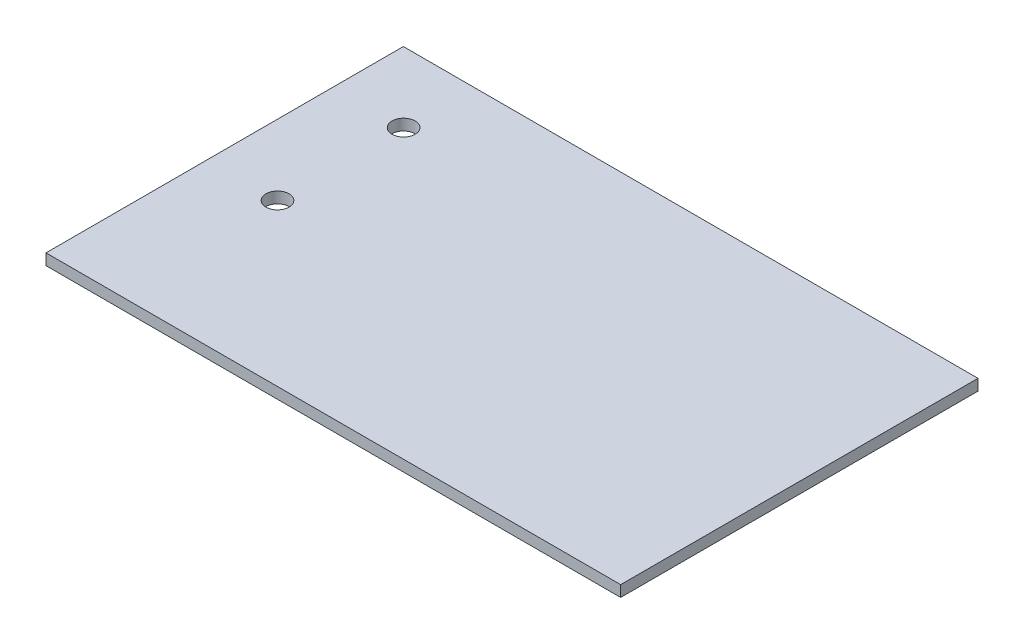
ISO-10303-21;
HEADER;
FILE_DESCRIPTION(('STEP AP214'),'2;1');
FILE_NAME('part.step','',(''),(''),'','','');
FILE_SCHEMA(('AUTOMOTIVE_DESIGN { 1 0 10303 214 1 1 1 1 }'));
ENDSEC;
DATA;
#1=APPLICATION_CONTEXT('core data for automotive mechanical design processes');
#2=APPLICATION_PROTOCOL_DEFINITION('international standard','automotive_design',2000,#1);
#3=PRODUCT_CONTEXT('',#1,'mechanical');
#4=PRODUCT('Part','Part','',(#3));
#5=PRODUCT_RELATED_PRODUCT_CATEGORY('part','',(#4));
#6=PRODUCT_DEFINITION_FORMATION('','',#4);
#7=PRODUCT_DEFINITION_CONTEXT('part definition',#1,'design');
#8=PRODUCT_DEFINITION('design','',#6,#7);
#9=PRODUCT_DEFINITION_SHAPE('','',#8);
#10=(LENGTH_UNIT() NAMED_UNIT(*) SI_UNIT(.MILLI.,.METRE.));
#11=(NAMED_UNIT(*) PLANE_ANGLE_UNIT() SI_UNIT($,.RADIAN.));
#12=(NAMED_UNIT(*) SI_UNIT($,.STERADIAN.) SOLID_ANGLE_UNIT());
#13=UNCERTAINTY_MEASURE_WITH_UNIT(LENGTH_MEASURE(1.E-05),#10,'distance_accuracy_value','');
#14=(GEOMETRIC_REPRESENTATION_CONTEXT(3) GLOBAL_UNCERTAINTY_ASSIGNED_CONTEXT((#13)) GLOBAL_UNIT_ASSIGNED_CONTEXT((#10,
#11,#12)) REPRESENTATION_CONTEXT('',''));
#15=CARTESIAN_POINT('',(0.,0.,0.));
#16=DIRECTION('',(0.,0.,1.));
#17=DIRECTION('',(1.,0.,0.));
#18=AXIS2_PLACEMENT_3D('',#15,#16,#17);
#19=CARTESIAN_POINT('',(0.,1.5875,0.));
#20=DIRECTION('',(1.,0.,0.));
#21=DIRECTION('',(0.,0.,-1.));
#22=AXIS2_PLACEMENT_3D('',#19,#20,#21);
#23=PLANE('',#22);
#24=DIRECTION('',(0.,0.,1.));
#25=VECTOR('',#24,1.);
#26=CARTESIAN_POINT('',(0.,0.,0.));
#27=LINE('',#26,#25);
#28=CARTESIAN_POINT('',(0.,0.,-50.991578633611));
#29=VERTEX_POINT('',#28);
#30=CARTESIAN_POINT('',(0.,0.,0.));
#31=VERTEX_POINT('',#30);
#32=EDGE_CURVE('E105',#29,#31,#27,.T.);
#33=ORIENTED_EDGE('',*,*,#32,.T.);
#34=DIRECTION('',(0.,-1.,0.));
#35=VECTOR('',#34,1.);
#36=CARTESIAN_POINT('',(0.,1.5875,0.));
#37=LINE('',#36,#35);
#38=CARTESIAN_POINT('',(0.,1.5875,0.));
#39=VERTEX_POINT('',#38);
#40=EDGE_CURVE('E11',#39,#31,#37,.T.);
#41=ORIENTED_EDGE('',*,*,#40,.F.);
#42=DIRECTION('',(0.,0.,1.));
#43=VECTOR('',#42,1.);
#44=CARTESIAN_POINT('',(0.,1.5875,0.));
#45=LINE('',#44,#43);
#46=CARTESIAN_POINT('',(0.,1.5875,-50.991578633611));
#47=VERTEX_POINT('',#46);
#48=EDGE_CURVE('E92',#47,#39,#45,.T.);
#49=ORIENTED_EDGE('',*,*,#48,.F.);
#50=DIRECTION('',(0.,-1.,0.));
#51=VECTOR('',#50,1.);
#52=CARTESIAN_POINT('',(0.,1.5875,-50.991578633611));
#53=LINE('',#52,#51);
#54=EDGE_CURVE('E101',#47,#29,#53,.T.);
#55=ORIENTED_EDGE('',*,*,#54,.T.);
#56=EDGE_LOOP('',(#33,#41,#49,#55));
#57=FACE_BOUND('',#56,.T.);
#58=ADVANCED_FACE('F39',(#57),#23,.F.);
#59=CARTESIAN_POINT('',(0.,1.5875,0.));
#60=DIRECTION('',(0.,0.,-1.));
#61=DIRECTION('',(-1.,0.,0.));
#62=AXIS2_PLACEMENT_3D('',#59,#60,#61);
#63=PLANE('',#62);
#64=DIRECTION('',(1.,0.,0.));
#65=VECTOR('',#64,1.);
#66=CARTESIAN_POINT('',(0.,0.,0.));
#67=LINE('',#66,#65);
#68=CARTESIAN_POINT('',(82.,0.,0.));
#69=VERTEX_POINT('',#68);
#70=EDGE_CURVE('E96',#31,#69,#67,.T.);
#71=ORIENTED_EDGE('',*,*,#70,.T.);
#72=DIRECTION('',(0.,-1.,0.));
#73=VECTOR('',#72,1.);
#74=CARTESIAN_POINT('',(82.,1.5875,0.));
#75=LINE('',#74,#73);
#76=CARTESIAN_POINT('',(82.,1.5875,0.));
#77=VERTEX_POINT('',#76);
#78=EDGE_CURVE('E48',#77,#69,#75,.T.);
#79=ORIENTED_EDGE('',*,*,#78,.F.);
#80=DIRECTION('',(1.,0.,0.));
#81=VECTOR('',#80,1.);
#82=CARTESIAN_POINT('',(0.,1.5875,0.));
#83=LINE('',#82,#81);
#84=EDGE_CURVE('E87',#39,#77,#83,.T.);
#85=ORIENTED_EDGE('',*,*,#84,.F.);
#86=ORIENTED_EDGE('',*,*,#40,.T.);
#87=EDGE_LOOP('',(#71,#79,#85,#86));
#88=FACE_BOUND('',#87,.T.);
#89=ADVANCED_FACE('F95',(#88),#63,.F.);
#90=CARTESIAN_POINT('',(82.,1.5875,0.));
#91=DIRECTION('',(-1.,0.,0.));
#92=DIRECTION('',(0.,0.,1.));
#93=AXIS2_PLACEMENT_3D('',#90,#91,#92);
#94=PLANE('',#93);
#95=DIRECTION('',(0.,0.,-1.));
#96=VECTOR('',#95,1.);
#97=CARTESIAN_POINT('',(82.,0.,0.));
#98=LINE('',#97,#96);
#99=CARTESIAN_POINT('',(82.,0.,-50.991578633611));
#100=VERTEX_POINT('',#99);
#101=EDGE_CURVE('E74',#69,#100,#98,.T.);
#102=ORIENTED_EDGE('',*,*,#101,.T.);
#103=DIRECTION('',(0.,-1.,0.));
#104=VECTOR('',#103,1.);
#105=CARTESIAN_POINT('',(82.,1.5875,-50.991578633611));
#106=LINE('',#105,#104);
#107=CARTESIAN_POINT('',(82.,1.5875,-50.991578633611));
#108=VERTEX_POINT('',#107);
#109=EDGE_CURVE('E97',#108,#100,#106,.T.);
#110=ORIENTED_EDGE('',*,*,#109,.F.);
#111=DIRECTION('',(0.,0.,-1.));
#112=VECTOR('',#111,1.);
#113=CARTESIAN_POINT('',(82.,1.5875,0.));
#114=LINE('',#113,#112);
#115=EDGE_CURVE('E90',#77,#108,#114,.T.);
#116=ORIENTED_EDGE('',*,*,#115,.F.);
#117=ORIENTED_EDGE('',*,*,#78,.T.);
#118=EDGE_LOOP('',(#102,#110,#116,#117));
#119=FACE_BOUND('',#118,.T.);
#120=ADVANCED_FACE('F99',(#119),#94,.F.);
#121=CARTESIAN_POINT('',(0.,1.5875,-50.991578633611));
#122=DIRECTION('',(0.,0.,1.));
#123=DIRECTION('',(1.,0.,0.));
#124=AXIS2_PLACEMENT_3D('',#121,#122,#123);
#125=PLANE('',#124);
#126=DIRECTION('',(-1.,0.,0.));
#127=VECTOR('',#126,1.);
#128=CARTESIAN_POINT('',(0.,0.,-50.991578633611));
#129=LINE('',#128,#127);
#130=EDGE_CURVE('E80',#100,#29,#129,.T.);
#131=ORIENTED_EDGE('',*,*,#130,.T.);
#132=ORIENTED_EDGE('',*,*,#54,.F.);
#133=DIRECTION('',(-1.,0.,0.));
#134=VECTOR('',#133,1.);
#135=CARTESIAN_POINT('',(0.,1.5875,-50.991578633611));
#136=LINE('',#135,#134);
#137=EDGE_CURVE('E57',#108,#47,#136,.T.);
#138=ORIENTED_EDGE('',*,*,#137,.F.);
#139=ORIENTED_EDGE('',*,*,#109,.T.);
#140=EDGE_LOOP('',(#131,#132,#138,#139));
#141=FACE_BOUND('',#140,.T.);
#142=ADVANCED_FACE('F131',(#141),#125,.F.);
#143=CARTESIAN_POINT('',(0.,1.5875,0.));
#144=DIRECTION('',(0.,-1.,0.));
#145=DIRECTION('',(0.,0.,-1.));
#146=AXIS2_PLACEMENT_3D('',#143,#144,#145);
#147=PLANE('',#146);
#148=CARTESIAN_POINT('',(10.04,1.5875,-40.991578633611));
#149=DIRECTION('',(0.,1.,0.));
#150=DIRECTION('',(0.,0.,1.));
#151=AXIS2_PLACEMENT_3D('',#148,#149,#150);
#152=CIRCLE('',#151,1.65);
#153=CARTESIAN_POINT('',(10.04,1.5875,-39.341578633611));
#154=VERTEX_POINT('',#153);
#155=EDGE_CURVE('E114',#154,#154,#152,.T.);
#156=ORIENTED_EDGE('',*,*,#155,.F.);
#157=EDGE_LOOP('',(#156));
#158=FACE_BOUND('',#157,.T.);
#159=CARTESIAN_POINT('',(10.04,1.5875,-22.991578633611));
#160=DIRECTION('',(0.,1.,0.));
#161=DIRECTION('',(0.,0.,1.));
#162=AXIS2_PLACEMENT_3D('',#159,#160,#161);
#163=CIRCLE('',#162,1.65);
#164=CARTESIAN_POINT('',(10.04,1.5875,-21.341578633611));
#165=VERTEX_POINT('',#164);
#166=EDGE_CURVE('E119',#165,#165,#163,.T.);
#167=ORIENTED_EDGE('',*,*,#166,.F.);
#168=EDGE_LOOP('',(#167));
#169=FACE_BOUND('',#168,.T.);
#170=ORIENTED_EDGE('',*,*,#48,.T.);
#171=ORIENTED_EDGE('',*,*,#84,.T.);
#172=ORIENTED_EDGE('',*,*,#115,.T.);
#173=ORIENTED_EDGE('',*,*,#137,.T.);
#174=EDGE_LOOP('',(#170,#171,#172,#173));
#175=FACE_BOUND('',#174,.T.);
#176=ADVANCED_FACE('F88',(#158,#169,#175),#147,.F.);
#177=CARTESIAN_POINT('',(0.,0.,0.));
#178=DIRECTION('',(0.,-1.,0.));
#179=DIRECTION('',(0.,0.,-1.));
#180=AXIS2_PLACEMENT_3D('',#177,#178,#179);
#181=PLANE('',#180);
#182=CARTESIAN_POINT('',(10.04,0.,-40.991578633611));
#183=DIRECTION('',(0.,-1.,0.));
#184=DIRECTION('',(0.,0.,-1.));
#185=AXIS2_PLACEMENT_3D('',#182,#183,#184);
#186=CIRCLE('',#185,1.65);
#187=CARTESIAN_POINT('',(10.04,0.,-42.641578633611));
#188=VERTEX_POINT('',#187);
#189=EDGE_CURVE('E42',#188,#188,#186,.T.);
#190=ORIENTED_EDGE('',*,*,#189,.F.);
#191=EDGE_LOOP('',(#190));
#192=FACE_BOUND('',#191,.T.);
#193=CARTESIAN_POINT('',(10.04,0.,-22.991578633611));
#194=DIRECTION('',(0.,-1.,0.));
#195=DIRECTION('',(0.,0.,-1.));
#196=AXIS2_PLACEMENT_3D('',#193,#194,#195);
#197=CIRCLE('',#196,1.65);
#198=CARTESIAN_POINT('',(10.04,0.,-24.641578633611));
#199=VERTEX_POINT('',#198);
#200=EDGE_CURVE('E112',#199,#199,#197,.T.);
#201=ORIENTED_EDGE('',*,*,#200,.F.);
#202=EDGE_LOOP('',(#201));
#203=FACE_BOUND('',#202,.T.);
#204=ORIENTED_EDGE('',*,*,#32,.F.);
#205=ORIENTED_EDGE('',*,*,#130,.F.);
#206=ORIENTED_EDGE('',*,*,#101,.F.);
#207=ORIENTED_EDGE('',*,*,#70,.F.);
#208=EDGE_LOOP('',(#204,#205,#206,#207));
#209=FACE_BOUND('',#208,.T.);
#210=ADVANCED_FACE('F130',(#192,#203,#209),#181,.T.);
#211=CARTESIAN_POINT('',(10.04,-8.4125,-22.991578633611));
#212=DIRECTION('',(0.,1.,0.));
#213=DIRECTION('',(0.,0.,1.));
#214=AXIS2_PLACEMENT_3D('',#211,#212,#213);
#215=CYLINDRICAL_SURFACE('',#214,1.65);
#216=ORIENTED_EDGE('',*,*,#200,.T.);
#217=EDGE_LOOP('',(#216));
#218=FACE_BOUND('',#217,.T.);
#219=ORIENTED_EDGE('',*,*,#166,.T.);
#220=EDGE_LOOP('',(#219));
#221=FACE_BOUND('',#220,.T.);
#222=ADVANCED_FACE('F127',(#218,#221),#215,.F.);
#223=CARTESIAN_POINT('',(10.04,-8.4125,-40.991578633611));
#224=DIRECTION('',(0.,1.,0.));
#225=DIRECTION('',(0.,0.,1.));
#226=AXIS2_PLACEMENT_3D('',#223,#224,#225);
#227=CYLINDRICAL_SURFACE('',#226,1.65);
#228=ORIENTED_EDGE('',*,*,#189,.T.);
#229=EDGE_LOOP('',(#228));
#230=FACE_BOUND('',#229,.T.);
#231=ORIENTED_EDGE('',*,*,#155,.T.);
#232=EDGE_LOOP('',(#231));
#233=FACE_BOUND('',#232,.T.);
#234=ADVANCED_FACE('F181',(#230,#233),#227,.F.);
#235=CLOSED_SHELL('',(#58,#89,#120,#142,#176,#210,#222,#234));
#236=MANIFOLD_SOLID_BREP('B2',#235);
#237=ADVANCED_BREP_SHAPE_REPRESENTATION('',(#18,#236),#14);
#238=SHAPE_DEFINITION_REPRESENTATION(#9,#237);
ENDSEC;
END-ISO-10303-21;
